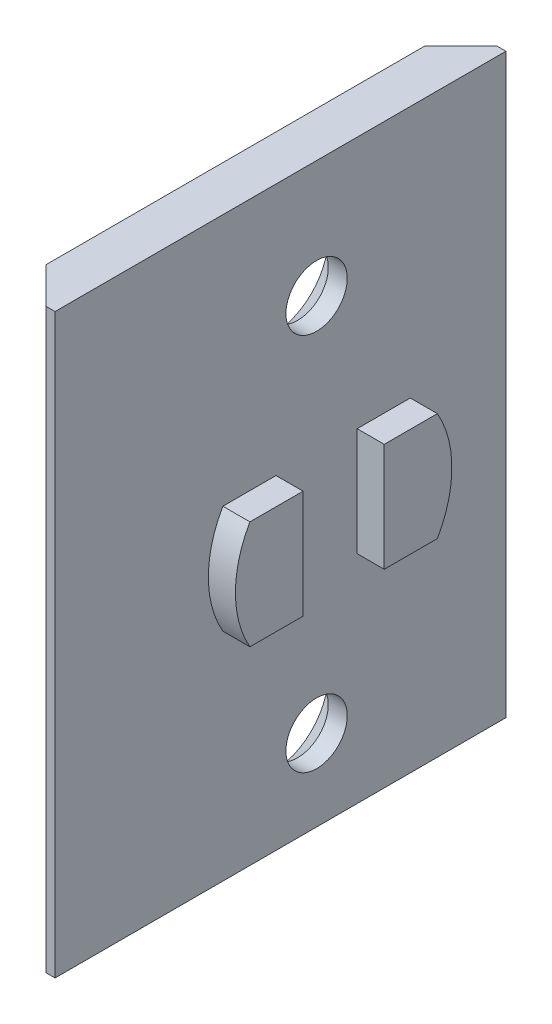
ISO-10303-21;
HEADER;
FILE_DESCRIPTION(('STEP AP214'),'2;1');
FILE_NAME('part.step','',(''),(''),'','','');
FILE_SCHEMA(('AUTOMOTIVE_DESIGN { 1 0 10303 214 1 1 1 1 }'));
ENDSEC;
DATA;
#1=APPLICATION_CONTEXT('core data for automotive mechanical design processes');
#2=APPLICATION_PROTOCOL_DEFINITION('international standard','automotive_design',2000,#1);
#3=PRODUCT_CONTEXT('',#1,'mechanical');
#4=PRODUCT('Part','Part','',(#3));
#5=PRODUCT_RELATED_PRODUCT_CATEGORY('part','',(#4));
#6=PRODUCT_DEFINITION_FORMATION('','',#4);
#7=PRODUCT_DEFINITION_CONTEXT('part definition',#1,'design');
#8=PRODUCT_DEFINITION('design','',#6,#7);
#9=PRODUCT_DEFINITION_SHAPE('','',#8);
#10=(LENGTH_UNIT() NAMED_UNIT(*) SI_UNIT(.MILLI.,.METRE.));
#11=(NAMED_UNIT(*) PLANE_ANGLE_UNIT() SI_UNIT($,.RADIAN.));
#12=(NAMED_UNIT(*) SI_UNIT($,.STERADIAN.) SOLID_ANGLE_UNIT());
#13=UNCERTAINTY_MEASURE_WITH_UNIT(LENGTH_MEASURE(1.E-05),#10,'distance_accuracy_value','');
#14=(GEOMETRIC_REPRESENTATION_CONTEXT(3) GLOBAL_UNCERTAINTY_ASSIGNED_CONTEXT((#13)) GLOBAL_UNIT_ASSIGNED_CONTEXT((#10,
#11,#12)) REPRESENTATION_CONTEXT('',''));
#15=CARTESIAN_POINT('',(0.,0.,0.));
#16=DIRECTION('',(0.,0.,1.));
#17=DIRECTION('',(1.,0.,0.));
#18=AXIS2_PLACEMENT_3D('',#15,#16,#17);
#19=CARTESIAN_POINT('',(4.,-1.,-2.00000000000008));
#20=DIRECTION('',(-1.,0.,0.));
#21=DIRECTION('',(0.,0.,1.00000000000003));
#22=AXIS2_PLACEMENT_3D('',#19,#20,#21);
#23=CYLINDRICAL_SURFACE('',#22,6.);
#24=DIRECTION('',(1.,0.,0.));
#25=VECTOR('',#24,1.);
#26=CARTESIAN_POINT('',(-8.31665382639201,-4.,3.19615242270658));
#27=LINE('',#26,#25);
#28=CARTESIAN_POINT('',(2.49999999999999,-4.,3.19615242270657));
#29=VERTEX_POINT('',#28);
#30=CARTESIAN_POINT('',(3.99999999999999,-4.,3.1961524227066));
#31=VERTEX_POINT('',#30);
#32=EDGE_CURVE('E53',#29,#31,#27,.T.);
#33=ORIENTED_EDGE('',*,*,#32,.T.);
#34=CARTESIAN_POINT('',(4.,-1.,-2.00000000000008));
#35=DIRECTION('',(1.,0.,0.));
#36=DIRECTION('',(0.,0.,-1.00000000000003));
#37=AXIS2_PLACEMENT_3D('',#34,#35,#36);
#38=CIRCLE('',#37,6.);
#39=CARTESIAN_POINT('',(4.,2.,3.1961524227066));
#40=VERTEX_POINT('',#39);
#41=EDGE_CURVE('E183',#40,#31,#38,.T.);
#42=ORIENTED_EDGE('',*,*,#41,.F.);
#43=DIRECTION('',(1.,0.,0.));
#44=VECTOR('',#43,1.);
#45=CARTESIAN_POINT('',(-8.31665382639201,2.00000000000001,3.19615242270658));
#46=LINE('',#45,#44);
#47=CARTESIAN_POINT('',(2.49999999999999,2.,3.1961524227066));
#48=VERTEX_POINT('',#47);
#49=EDGE_CURVE('E162',#48,#40,#46,.T.);
#50=ORIENTED_EDGE('',*,*,#49,.F.);
#51=CARTESIAN_POINT('',(2.5,-1.,-2.00000000000008));
#52=DIRECTION('',(-1.,0.,0.));
#53=DIRECTION('',(0.,0.,1.00000000000003));
#54=AXIS2_PLACEMENT_3D('',#51,#52,#53);
#55=CIRCLE('',#54,6.);
#56=EDGE_CURVE('E42',#48,#29,#55,.F.);
#57=ORIENTED_EDGE('',*,*,#56,.T.);
#58=EDGE_LOOP('',(#33,#42,#50,#57));
#59=FACE_BOUND('',#58,.T.);
#60=ADVANCED_FACE('F38',(#59),#23,.T.);
#61=CARTESIAN_POINT('',(4.,0.,0.));
#62=DIRECTION('',(1.,0.,0.));
#63=DIRECTION('',(0.,0.,-1.00000000000003));
#64=AXIS2_PLACEMENT_3D('',#61,#62,#63);
#65=PLANE('',#64);
#66=ORIENTED_EDGE('',*,*,#41,.T.);
#67=DIRECTION('',(0.,0.,-1.));
#68=VECTOR('',#67,1.);
#69=CARTESIAN_POINT('',(4.,-4.,0.));
#70=LINE('',#69,#68);
#71=CARTESIAN_POINT('',(4.,-4.,0.249999999999979));
#72=VERTEX_POINT('',#71);
#73=EDGE_CURVE('E260',#31,#72,#70,.T.);
#74=ORIENTED_EDGE('',*,*,#73,.T.);
#75=DIRECTION('',(0.,1.,0.));
#76=VECTOR('',#75,1.);
#77=CARTESIAN_POINT('',(4.,0.,0.24999999999999));
#78=LINE('',#77,#76);
#79=CARTESIAN_POINT('',(4.,2.,0.249999999999999));
#80=VERTEX_POINT('',#79);
#81=EDGE_CURVE('E179',#72,#80,#78,.T.);
#82=ORIENTED_EDGE('',*,*,#81,.T.);
#83=DIRECTION('',(0.,0.,-1.));
#84=VECTOR('',#83,1.);
#85=CARTESIAN_POINT('',(4.,2.,0.));
#86=LINE('',#85,#84);
#87=EDGE_CURVE('E166',#40,#80,#86,.T.);
#88=ORIENTED_EDGE('',*,*,#87,.F.);
#89=EDGE_LOOP('',(#66,#74,#82,#88));
#90=FACE_BOUND('',#89,.T.);
#91=ADVANCED_FACE('F281',(#90),#65,.T.);
#92=CARTESIAN_POINT('',(4.,0.,-4.25000000000014));
#93=DIRECTION('',(0.,0.,1.00000000000003));
#94=DIRECTION('',(1.,0.,0.));
#95=AXIS2_PLACEMENT_3D('',#92,#93,#94);
#96=PLANE('',#95);
#97=DIRECTION('',(0.,1.,0.));
#98=VECTOR('',#97,1.);
#99=CARTESIAN_POINT('',(2.5,0.,-4.25000000000014));
#100=LINE('',#99,#98);
#101=CARTESIAN_POINT('',(2.5,-4.,-4.25000000000015));
#102=VERTEX_POINT('',#101);
#103=CARTESIAN_POINT('',(2.50000000000001,2.,-4.25000000000014));
#104=VERTEX_POINT('',#103);
#105=EDGE_CURVE('E157',#102,#104,#100,.T.);
#106=ORIENTED_EDGE('',*,*,#105,.F.);
#107=DIRECTION('',(1.,0.,0.));
#108=VECTOR('',#107,1.);
#109=CARTESIAN_POINT('',(4.,-4.,-4.25000000000016));
#110=LINE('',#109,#108);
#111=CARTESIAN_POINT('',(4.,-4.,-4.25000000000009));
#112=VERTEX_POINT('',#111);
#113=EDGE_CURVE('E143',#102,#112,#110,.T.);
#114=ORIENTED_EDGE('',*,*,#113,.T.);
#115=DIRECTION('',(0.,1.,0.));
#116=VECTOR('',#115,1.);
#117=CARTESIAN_POINT('',(4.,0.,-4.25000000000014));
#118=LINE('',#117,#116);
#119=CARTESIAN_POINT('',(4.00000000000001,2.,-4.25000000000009));
#120=VERTEX_POINT('',#119);
#121=EDGE_CURVE('E177',#112,#120,#118,.T.);
#122=ORIENTED_EDGE('',*,*,#121,.T.);
#123=DIRECTION('',(1.,0.,0.));
#124=VECTOR('',#123,1.);
#125=CARTESIAN_POINT('',(4.,2.,-4.25000000000014));
#126=LINE('',#125,#124);
#127=EDGE_CURVE('E175',#104,#120,#126,.T.);
#128=ORIENTED_EDGE('',*,*,#127,.F.);
#129=EDGE_LOOP('',(#106,#114,#122,#128));
#130=FACE_BOUND('',#129,.T.);
#131=ADVANCED_FACE('F284',(#130),#96,.T.);
#132=CARTESIAN_POINT('',(4.,0.,0.24999999999999));
#133=DIRECTION('',(0.,0.,1.00000000000003));
#134=DIRECTION('',(1.,0.,0.));
#135=AXIS2_PLACEMENT_3D('',#132,#133,#134);
#136=PLANE('',#135);
#137=DIRECTION('',(1.,0.,0.));
#138=VECTOR('',#137,1.);
#139=CARTESIAN_POINT('',(4.,-4.,0.249999999999978));
#140=LINE('',#139,#138);
#141=CARTESIAN_POINT('',(2.5,-4.,0.250000000000004));
#142=VERTEX_POINT('',#141);
#143=EDGE_CURVE('E264',#142,#72,#140,.T.);
#144=ORIENTED_EDGE('',*,*,#143,.F.);
#145=DIRECTION('',(0.,1.,0.));
#146=VECTOR('',#145,1.);
#147=CARTESIAN_POINT('',(2.5,0.,0.24999999999999));
#148=LINE('',#147,#146);
#149=CARTESIAN_POINT('',(2.5,2.,0.250000000000005));
#150=VERTEX_POINT('',#149);
#151=EDGE_CURVE('E180',#142,#150,#148,.T.);
#152=ORIENTED_EDGE('',*,*,#151,.T.);
#153=DIRECTION('',(1.,0.,0.));
#154=VECTOR('',#153,1.);
#155=CARTESIAN_POINT('',(4.,2.,0.249999999999997));
#156=LINE('',#155,#154);
#157=EDGE_CURVE('E172',#150,#80,#156,.T.);
#158=ORIENTED_EDGE('',*,*,#157,.T.);
#159=ORIENTED_EDGE('',*,*,#81,.F.);
#160=EDGE_LOOP('',(#144,#152,#158,#159));
#161=FACE_BOUND('',#160,.T.);
#162=ADVANCED_FACE('F278',(#161),#136,.F.);
#163=DIRECTION('',(1.,0.,0.));
#164=VECTOR('',#163,1.);
#165=CARTESIAN_POINT('',(-8.31665382639199,-4.,-7.19615242270675));
#166=LINE('',#165,#164);
#167=CARTESIAN_POINT('',(2.49999999999999,-4.,-7.19615242270673));
#168=VERTEX_POINT('',#167);
#169=CARTESIAN_POINT('',(4.00000000000001,-4.,-7.19615242270672));
#170=VERTEX_POINT('',#169);
#171=EDGE_CURVE('E140',#168,#170,#166,.T.);
#172=ORIENTED_EDGE('',*,*,#171,.F.);
#173=CARTESIAN_POINT('',(2.50000000000001,2.,-7.19615242270673));
#174=VERTEX_POINT('',#173);
#175=EDGE_CURVE('E11',#168,#174,#55,.F.);
#176=ORIENTED_EDGE('',*,*,#175,.T.);
#177=DIRECTION('',(1.,0.,0.));
#178=VECTOR('',#177,1.);
#179=CARTESIAN_POINT('',(-8.31665382639199,2.00000000000001,-7.19615242270675));
#180=LINE('',#179,#178);
#181=CARTESIAN_POINT('',(4.00000000000001,2.,-7.19615242270673));
#182=VERTEX_POINT('',#181);
#183=EDGE_CURVE('E165',#174,#182,#180,.T.);
#184=ORIENTED_EDGE('',*,*,#183,.T.);
#185=EDGE_CURVE('E150',#170,#182,#38,.T.);
#186=ORIENTED_EDGE('',*,*,#185,.F.);
#187=EDGE_LOOP('',(#172,#176,#184,#186));
#188=FACE_BOUND('',#187,.T.);
#189=ADVANCED_FACE('F149',(#188),#23,.T.);
#190=ORIENTED_EDGE('',*,*,#121,.F.);
#191=EDGE_CURVE('E263',#112,#170,#70,.T.);
#192=ORIENTED_EDGE('',*,*,#191,.T.);
#193=ORIENTED_EDGE('',*,*,#185,.T.);
#194=EDGE_CURVE('E265',#120,#182,#86,.T.);
#195=ORIENTED_EDGE('',*,*,#194,.F.);
#196=EDGE_LOOP('',(#190,#192,#193,#195));
#197=FACE_BOUND('',#196,.T.);
#198=ADVANCED_FACE('F283',(#197),#65,.T.);
#199=CARTESIAN_POINT('',(2.5,-16.,-12.5000000000003));
#200=DIRECTION('',(0.,0.,1.00000000000003));
#201=DIRECTION('',(1.,0.,0.));
#202=AXIS2_PLACEMENT_3D('',#199,#200,#201);
#203=PLANE('',#202);
#204=DIRECTION('',(-1.,0.,0.));
#205=VECTOR('',#204,1.);
#206=CARTESIAN_POINT('',(2.5,-16.,-12.5000000000003));
#207=LINE('',#206,#205);
#208=CARTESIAN_POINT('',(2.5,-16.,-12.5000000000003));
#209=VERTEX_POINT('',#208);
#210=CARTESIAN_POINT('',(2.,-16.,-12.5000000000003));
#211=VERTEX_POINT('',#210);
#212=EDGE_CURVE('E215',#209,#211,#207,.T.);
#213=ORIENTED_EDGE('',*,*,#212,.T.);
#214=DIRECTION('',(0.,1.,0.));
#215=VECTOR('',#214,1.);
#216=CARTESIAN_POINT('',(2.,16.,-12.5000000000005));
#217=LINE('',#216,#215);
#218=CARTESIAN_POINT('',(2.,16.,-12.5000000000005));
#219=VERTEX_POINT('',#218);
#220=EDGE_CURVE('E245',#211,#219,#217,.T.);
#221=ORIENTED_EDGE('',*,*,#220,.T.);
#222=DIRECTION('',(-1.,0.,0.));
#223=VECTOR('',#222,1.);
#224=CARTESIAN_POINT('',(2.5,16.,-12.5000000000005));
#225=LINE('',#224,#223);
#226=CARTESIAN_POINT('',(2.5,16.,-12.5000000000005));
#227=VERTEX_POINT('',#226);
#228=EDGE_CURVE('E228',#227,#219,#225,.T.);
#229=ORIENTED_EDGE('',*,*,#228,.F.);
#230=DIRECTION('',(0.,1.,0.));
#231=VECTOR('',#230,1.);
#232=CARTESIAN_POINT('',(2.5,-16.,-12.5000000000003));
#233=LINE('',#232,#231);
#234=EDGE_CURVE('E205',#209,#227,#233,.T.);
#235=ORIENTED_EDGE('',*,*,#234,.F.);
#236=EDGE_LOOP('',(#213,#221,#229,#235));
#237=FACE_BOUND('',#236,.T.);
#238=ADVANCED_FACE('F307',(#237),#203,.F.);
#239=CARTESIAN_POINT('',(2.5,16.,12.5000000000005));
#240=DIRECTION('',(0.,-1.,0.));
#241=DIRECTION('',(0.,0.,-1.00000000000003));
#242=AXIS2_PLACEMENT_3D('',#239,#240,#241);
#243=PLANE('',#242);
#244=DIRECTION('',(0.,0.,1.00000000000003));
#245=VECTOR('',#244,1.);
#246=CARTESIAN_POINT('',(0.,16.,12.5000000000003));
#247=LINE('',#246,#245);
#248=CARTESIAN_POINT('',(0.,16.,-10.5000000000005));
#249=VERTEX_POINT('',#248);
#250=CARTESIAN_POINT('',(0.,16.,10.5000000000003));
#251=VERTEX_POINT('',#250);
#252=EDGE_CURVE('E204',#249,#251,#247,.T.);
#253=ORIENTED_EDGE('',*,*,#252,.T.);
#254=DIRECTION('',(0.707106781186547,0.,0.707106781186564));
#255=VECTOR('',#254,1.);
#256=CARTESIAN_POINT('',(2.,16.,12.5000000000005));
#257=LINE('',#256,#255);
#258=CARTESIAN_POINT('',(2.,16.,12.5000000000005));
#259=VERTEX_POINT('',#258);
#260=EDGE_CURVE('E244',#251,#259,#257,.T.);
#261=ORIENTED_EDGE('',*,*,#260,.T.);
#262=DIRECTION('',(-1.,0.,0.));
#263=VECTOR('',#262,1.);
#264=CARTESIAN_POINT('',(2.5,16.,12.5000000000005));
#265=LINE('',#264,#263);
#266=CARTESIAN_POINT('',(2.5,16.,12.5000000000005));
#267=VERTEX_POINT('',#266);
#268=EDGE_CURVE('E225',#267,#259,#265,.T.);
#269=ORIENTED_EDGE('',*,*,#268,.F.);
#270=DIRECTION('',(0.,0.,1.00000000000003));
#271=VECTOR('',#270,1.);
#272=CARTESIAN_POINT('',(2.5,16.,12.5000000000005));
#273=LINE('',#272,#271);
#274=EDGE_CURVE('E208',#227,#267,#273,.T.);
#275=ORIENTED_EDGE('',*,*,#274,.F.);
#276=ORIENTED_EDGE('',*,*,#228,.T.);
#277=DIRECTION('',(-0.707106781186547,0.,0.707106781186564));
#278=VECTOR('',#277,1.);
#279=CARTESIAN_POINT('',(2.,16.,-12.5000000000005));
#280=LINE('',#279,#278);
#281=EDGE_CURVE('E242',#219,#249,#280,.T.);
#282=ORIENTED_EDGE('',*,*,#281,.T.);
#283=EDGE_LOOP('',(#253,#261,#269,#275,#276,#282));
#284=FACE_BOUND('',#283,.T.);
#285=ADVANCED_FACE('F340',(#284),#243,.F.);
#286=CARTESIAN_POINT('',(2.5,-16.,12.5000000000005));
#287=DIRECTION('',(0.,0.,-1.00000000000003));
#288=DIRECTION('',(-1.,0.,0.));
#289=AXIS2_PLACEMENT_3D('',#286,#287,#288);
#290=PLANE('',#289);
#291=ORIENTED_EDGE('',*,*,#268,.T.);
#292=DIRECTION('',(0.,-1.,0.));
#293=VECTOR('',#292,1.);
#294=CARTESIAN_POINT('',(2.,-16.,12.5000000000005));
#295=LINE('',#294,#293);
#296=CARTESIAN_POINT('',(2.,-16.,12.5000000000005));
#297=VERTEX_POINT('',#296);
#298=EDGE_CURVE('E231',#259,#297,#295,.T.);
#299=ORIENTED_EDGE('',*,*,#298,.T.);
#300=DIRECTION('',(-1.,0.,0.));
#301=VECTOR('',#300,1.);
#302=CARTESIAN_POINT('',(2.5,-16.,12.5000000000005));
#303=LINE('',#302,#301);
#304=CARTESIAN_POINT('',(2.5,-16.,12.5000000000005));
#305=VERTEX_POINT('',#304);
#306=EDGE_CURVE('E222',#305,#297,#303,.T.);
#307=ORIENTED_EDGE('',*,*,#306,.F.);
#308=DIRECTION('',(0.,-1.,0.));
#309=VECTOR('',#308,1.);
#310=CARTESIAN_POINT('',(2.5,-16.,12.5000000000005));
#311=LINE('',#310,#309);
#312=EDGE_CURVE('E211',#267,#305,#311,.T.);
#313=ORIENTED_EDGE('',*,*,#312,.F.);
#314=EDGE_LOOP('',(#291,#299,#307,#313));
#315=FACE_BOUND('',#314,.T.);
#316=ADVANCED_FACE('F336',(#315),#290,.F.);
#317=CARTESIAN_POINT('',(2.5,-16.,12.5000000000005));
#318=DIRECTION('',(0.,1.,0.));
#319=DIRECTION('',(0.,0.,1.00000000000003));
#320=AXIS2_PLACEMENT_3D('',#317,#318,#319);
#321=PLANE('',#320);
#322=ORIENTED_EDGE('',*,*,#306,.T.);
#323=DIRECTION('',(-0.707106781186547,0.,-0.707106781186564));
#324=VECTOR('',#323,1.);
#325=CARTESIAN_POINT('',(2.,-16.,12.5000000000005));
#326=LINE('',#325,#324);
#327=CARTESIAN_POINT('',(0.,-16.,10.5000000000005));
#328=VERTEX_POINT('',#327);
#329=EDGE_CURVE('E236',#297,#328,#326,.T.);
#330=ORIENTED_EDGE('',*,*,#329,.T.);
#331=DIRECTION('',(0.,0.,-1.00000000000003));
#332=VECTOR('',#331,1.);
#333=CARTESIAN_POINT('',(0.,-16.,12.5000000000005));
#334=LINE('',#333,#332);
#335=CARTESIAN_POINT('',(0.,-16.,-10.5000000000002));
#336=VERTEX_POINT('',#335);
#337=EDGE_CURVE('E209',#328,#336,#334,.T.);
#338=ORIENTED_EDGE('',*,*,#337,.T.);
#339=DIRECTION('',(0.707106781186547,0.,-0.707106781186564));
#340=VECTOR('',#339,1.);
#341=CARTESIAN_POINT('',(2.,-16.,-12.5000000000003));
#342=LINE('',#341,#340);
#343=EDGE_CURVE('E234',#336,#211,#342,.T.);
#344=ORIENTED_EDGE('',*,*,#343,.T.);
#345=ORIENTED_EDGE('',*,*,#212,.F.);
#346=DIRECTION('',(0.,0.,-1.00000000000003));
#347=VECTOR('',#346,1.);
#348=CARTESIAN_POINT('',(2.5,-16.,12.5000000000005));
#349=LINE('',#348,#347);
#350=EDGE_CURVE('E213',#305,#209,#349,.T.);
#351=ORIENTED_EDGE('',*,*,#350,.F.);
#352=EDGE_LOOP('',(#322,#330,#338,#344,#345,#351));
#353=FACE_BOUND('',#352,.T.);
#354=ADVANCED_FACE('F332',(#353),#321,.F.);
#355=CARTESIAN_POINT('',(0.,0.,0.));
#356=DIRECTION('',(-1.,0.,0.));
#357=DIRECTION('',(0.,0.,1.00000000000003));
#358=AXIS2_PLACEMENT_3D('',#355,#356,#357);
#359=PLANE('',#358);
#360=CARTESIAN_POINT('',(0.,-11.5,-2.00000000000007));
#361=DIRECTION('',(-1.,0.,0.));
#362=DIRECTION('',(0.,0.,1.00000000000003));
#363=AXIS2_PLACEMENT_3D('',#360,#361,#362);
#364=CIRCLE('',#363,3.15);
#365=CARTESIAN_POINT('',(0.,-11.5,1.15000000000003));
#366=VERTEX_POINT('',#365);
#367=EDGE_CURVE('E186',#366,#366,#364,.T.);
#368=ORIENTED_EDGE('',*,*,#367,.F.);
#369=EDGE_LOOP('',(#368));
#370=FACE_BOUND('',#369,.T.);
#371=CARTESIAN_POINT('',(0.,9.5,-2.00000000000014));
#372=DIRECTION('',(-1.,0.,0.));
#373=DIRECTION('',(0.,0.,1.00000000000003));
#374=AXIS2_PLACEMENT_3D('',#371,#372,#373);
#375=CIRCLE('',#374,3.15);
#376=CARTESIAN_POINT('',(0.,9.49999999999999,1.14999999999996));
#377=VERTEX_POINT('',#376);
#378=EDGE_CURVE('E195',#377,#377,#375,.T.);
#379=ORIENTED_EDGE('',*,*,#378,.F.);
#380=EDGE_LOOP('',(#379));
#381=FACE_BOUND('',#380,.T.);
#382=ORIENTED_EDGE('',*,*,#337,.F.);
#383=DIRECTION('',(0.,1.,0.));
#384=VECTOR('',#383,1.);
#385=CARTESIAN_POINT('',(0.,16.,10.5000000000003));
#386=LINE('',#385,#384);
#387=EDGE_CURVE('E240',#328,#251,#386,.T.);
#388=ORIENTED_EDGE('',*,*,#387,.T.);
#389=ORIENTED_EDGE('',*,*,#252,.F.);
#390=DIRECTION('',(0.,-1.,0.));
#391=VECTOR('',#390,1.);
#392=CARTESIAN_POINT('',(0.,-16.,-10.5000000000002));
#393=LINE('',#392,#391);
#394=EDGE_CURVE('E238',#249,#336,#393,.T.);
#395=ORIENTED_EDGE('',*,*,#394,.T.);
#396=EDGE_LOOP('',(#382,#388,#389,#395));
#397=FACE_BOUND('',#396,.T.);
#398=ADVANCED_FACE('F328',(#370,#381,#397),#359,.T.);
#399=CARTESIAN_POINT('',(2.,-16.,12.5000000000005));
#400=DIRECTION('',(-0.707106781186548,0.,0.707106781186563));
#401=DIRECTION('',(0.,1.,0.));
#402=AXIS2_PLACEMENT_3D('',#399,#400,#401);
#403=PLANE('',#402);
#404=ORIENTED_EDGE('',*,*,#260,.F.);
#405=ORIENTED_EDGE('',*,*,#387,.F.);
#406=ORIENTED_EDGE('',*,*,#329,.F.);
#407=ORIENTED_EDGE('',*,*,#298,.F.);
#408=EDGE_LOOP('',(#404,#405,#406,#407));
#409=FACE_BOUND('',#408,.T.);
#410=ADVANCED_FACE('F331',(#409),#403,.T.);
#411=CARTESIAN_POINT('',(2.,-16.,-12.5000000000003));
#412=DIRECTION('',(-0.707106781186548,0.,-0.707106781186563));
#413=DIRECTION('',(0.,-1.,0.));
#414=AXIS2_PLACEMENT_3D('',#411,#412,#413);
#415=PLANE('',#414);
#416=ORIENTED_EDGE('',*,*,#343,.F.);
#417=ORIENTED_EDGE('',*,*,#394,.F.);
#418=ORIENTED_EDGE('',*,*,#281,.F.);
#419=ORIENTED_EDGE('',*,*,#220,.F.);
#420=EDGE_LOOP('',(#416,#417,#418,#419));
#421=FACE_BOUND('',#420,.T.);
#422=ADVANCED_FACE('F40',(#421),#415,.T.);
#423=CARTESIAN_POINT('',(0.,9.5,-2.00000000000014));
#424=DIRECTION('',(-1.,0.,0.));
#425=DIRECTION('',(0.,0.,1.00000000000003));
#426=AXIS2_PLACEMENT_3D('',#423,#424,#425);
#427=CYLINDRICAL_SURFACE('',#426,1.7);
#428=CARTESIAN_POINT('',(2.5,9.5,-2.00000000000014));
#429=DIRECTION('',(-1.,0.,0.));
#430=DIRECTION('',(0.,0.,1.00000000000003));
#431=AXIS2_PLACEMENT_3D('',#428,#429,#430);
#432=CIRCLE('',#431,1.7);
#433=CARTESIAN_POINT('',(2.5,9.49999999999999,-0.300000000000088));
#434=VERTEX_POINT('',#433);
#435=EDGE_CURVE('E201',#434,#434,#432,.T.);
#436=ORIENTED_EDGE('',*,*,#435,.F.);
#437=EDGE_LOOP('',(#436));
#438=FACE_BOUND('',#437,.T.);
#439=CARTESIAN_POINT('',(1.45,9.5,-2.00000000000014));
#440=DIRECTION('',(-1.,0.,0.));
#441=DIRECTION('',(0.,0.,1.00000000000003));
#442=AXIS2_PLACEMENT_3D('',#439,#440,#441);
#443=CIRCLE('',#442,1.7);
#444=CARTESIAN_POINT('',(1.45000000000001,9.49999999999999,-0.300000000000088));
#445=VERTEX_POINT('',#444);
#446=EDGE_CURVE('E198',#445,#445,#443,.T.);
#447=ORIENTED_EDGE('',*,*,#446,.T.);
#448=EDGE_LOOP('',(#447));
#449=FACE_BOUND('',#448,.T.);
#450=ADVANCED_FACE('F323',(#438,#449),#427,.F.);
#451=CARTESIAN_POINT('',(0.,9.5,-2.00000000000014));
#452=DIRECTION('',(-1.,0.,0.));
#453=DIRECTION('',(0.,0.,1.00000000000003));
#454=AXIS2_PLACEMENT_3D('',#451,#452,#453);
#455=CONICAL_SURFACE('',#454,3.15,0.785398163397448);
#456=ORIENTED_EDGE('',*,*,#446,.F.);
#457=EDGE_LOOP('',(#456));
#458=FACE_BOUND('',#457,.T.);
#459=ORIENTED_EDGE('',*,*,#378,.T.);
#460=EDGE_LOOP('',(#459));
#461=FACE_BOUND('',#460,.T.);
#462=ADVANCED_FACE('F319',(#458,#461),#455,.F.);
#463=CARTESIAN_POINT('',(0.,-11.5,-2.00000000000007));
#464=DIRECTION('',(-1.,0.,0.));
#465=DIRECTION('',(0.,0.,1.00000000000003));
#466=AXIS2_PLACEMENT_3D('',#463,#464,#465);
#467=CYLINDRICAL_SURFACE('',#466,1.7);
#468=CARTESIAN_POINT('',(2.5,-11.5,-2.00000000000001));
#469=DIRECTION('',(-1.,0.,0.));
#470=DIRECTION('',(0.,0.,1.00000000000003));
#471=AXIS2_PLACEMENT_3D('',#468,#469,#470);
#472=CIRCLE('',#471,1.7);
#473=CARTESIAN_POINT('',(2.5,-11.5,-0.29999999999996));
#474=VERTEX_POINT('',#473);
#475=EDGE_CURVE('E192',#474,#474,#472,.T.);
#476=ORIENTED_EDGE('',*,*,#475,.F.);
#477=EDGE_LOOP('',(#476));
#478=FACE_BOUND('',#477,.T.);
#479=CARTESIAN_POINT('',(1.45,-11.5,-2.00000000000001));
#480=DIRECTION('',(-1.,0.,0.));
#481=DIRECTION('',(0.,0.,1.00000000000003));
#482=AXIS2_PLACEMENT_3D('',#479,#480,#481);
#483=CIRCLE('',#482,1.7);
#484=CARTESIAN_POINT('',(1.45000000000001,-11.5,-0.29999999999996));
#485=VERTEX_POINT('',#484);
#486=EDGE_CURVE('E189',#485,#485,#483,.T.);
#487=ORIENTED_EDGE('',*,*,#486,.T.);
#488=EDGE_LOOP('',(#487));
#489=FACE_BOUND('',#488,.T.);
#490=ADVANCED_FACE('F315',(#478,#489),#467,.F.);
#491=CARTESIAN_POINT('',(0.,-11.5,-2.00000000000007));
#492=DIRECTION('',(-1.,0.,0.));
#493=DIRECTION('',(0.,0.,1.00000000000003));
#494=AXIS2_PLACEMENT_3D('',#491,#492,#493);
#495=CONICAL_SURFACE('',#494,3.15,0.785398163397448);
#496=ORIENTED_EDGE('',*,*,#486,.F.);
#497=EDGE_LOOP('',(#496));
#498=FACE_BOUND('',#497,.T.);
#499=ORIENTED_EDGE('',*,*,#367,.T.);
#500=EDGE_LOOP('',(#499));
#501=FACE_BOUND('',#500,.T.);
#502=ADVANCED_FACE('F292',(#498,#501),#495,.F.);
#503=CARTESIAN_POINT('',(2.5,0.,0.));
#504=DIRECTION('',(-1.,0.,0.));
#505=DIRECTION('',(0.,0.,1.00000000000003));
#506=AXIS2_PLACEMENT_3D('',#503,#504,#505);
#507=PLANE('',#506);
#508=DIRECTION('',(0.,0.,-1.));
#509=VECTOR('',#508,1.);
#510=CARTESIAN_POINT('',(2.5,-4.,0.));
#511=LINE('',#510,#509);
#512=EDGE_CURVE('E138',#102,#168,#511,.T.);
#513=ORIENTED_EDGE('',*,*,#512,.F.);
#514=ORIENTED_EDGE('',*,*,#105,.T.);
#515=DIRECTION('',(0.,0.,-1.));
#516=VECTOR('',#515,1.);
#517=CARTESIAN_POINT('',(2.5,2.,0.));
#518=LINE('',#517,#516);
#519=EDGE_CURVE('E156',#104,#174,#518,.T.);
#520=ORIENTED_EDGE('',*,*,#519,.T.);
#521=ORIENTED_EDGE('',*,*,#175,.F.);
#522=EDGE_LOOP('',(#513,#514,#520,#521));
#523=FACE_BOUND('',#522,.T.);
#524=ORIENTED_EDGE('',*,*,#151,.F.);
#525=EDGE_CURVE('E146',#29,#142,#511,.T.);
#526=ORIENTED_EDGE('',*,*,#525,.F.);
#527=ORIENTED_EDGE('',*,*,#56,.F.);
#528=EDGE_CURVE('E161',#48,#150,#518,.T.);
#529=ORIENTED_EDGE('',*,*,#528,.T.);
#530=EDGE_LOOP('',(#524,#526,#527,#529));
#531=FACE_BOUND('',#530,.T.);
#532=ORIENTED_EDGE('',*,*,#234,.T.);
#533=ORIENTED_EDGE('',*,*,#274,.T.);
#534=ORIENTED_EDGE('',*,*,#312,.T.);
#535=ORIENTED_EDGE('',*,*,#350,.T.);
#536=EDGE_LOOP('',(#532,#533,#534,#535));
#537=FACE_BOUND('',#536,.T.);
#538=ORIENTED_EDGE('',*,*,#435,.T.);
#539=EDGE_LOOP('',(#538));
#540=FACE_BOUND('',#539,.T.);
#541=ORIENTED_EDGE('',*,*,#475,.T.);
#542=EDGE_LOOP('',(#541));
#543=FACE_BOUND('',#542,.T.);
#544=ADVANCED_FACE('F153',(#523,#531,#537,#540,#543),#507,.F.);
#545=CARTESIAN_POINT('',(-8.31665382639201,2.00000000000001,0.));
#546=DIRECTION('',(0.,-1.,0.));
#547=DIRECTION('',(1.,0.,0.));
#548=AXIS2_PLACEMENT_3D('',#545,#546,#547);
#549=PLANE('',#548);
#550=ORIENTED_EDGE('',*,*,#127,.T.);
#551=ORIENTED_EDGE('',*,*,#194,.T.);
#552=ORIENTED_EDGE('',*,*,#183,.F.);
#553=ORIENTED_EDGE('',*,*,#519,.F.);
#554=EDGE_LOOP('',(#550,#551,#552,#553));
#555=FACE_BOUND('',#554,.T.);
#556=ADVANCED_FACE('F285',(#555),#549,.F.);
#557=ORIENTED_EDGE('',*,*,#528,.F.);
#558=ORIENTED_EDGE('',*,*,#49,.T.);
#559=ORIENTED_EDGE('',*,*,#87,.T.);
#560=ORIENTED_EDGE('',*,*,#157,.F.);
#561=EDGE_LOOP('',(#557,#558,#559,#560));
#562=FACE_BOUND('',#561,.T.);
#563=ADVANCED_FACE('F274',(#562),#549,.F.);
#564=CARTESIAN_POINT('',(-8.31665382639201,-4.,0.));
#565=DIRECTION('',(0.,-1.,0.));
#566=DIRECTION('',(1.,0.,0.));
#567=AXIS2_PLACEMENT_3D('',#564,#565,#566);
#568=PLANE('',#567);
#569=ORIENTED_EDGE('',*,*,#143,.T.);
#570=ORIENTED_EDGE('',*,*,#73,.F.);
#571=ORIENTED_EDGE('',*,*,#32,.F.);
#572=ORIENTED_EDGE('',*,*,#525,.T.);
#573=EDGE_LOOP('',(#569,#570,#571,#572));
#574=FACE_BOUND('',#573,.T.);
#575=ADVANCED_FACE('F280',(#574),#568,.T.);
#576=ORIENTED_EDGE('',*,*,#512,.T.);
#577=ORIENTED_EDGE('',*,*,#171,.T.);
#578=ORIENTED_EDGE('',*,*,#191,.F.);
#579=ORIENTED_EDGE('',*,*,#113,.F.);
#580=EDGE_LOOP('',(#576,#577,#578,#579));
#581=FACE_BOUND('',#580,.T.);
#582=ADVANCED_FACE('F139',(#581),#568,.T.);
#583=CLOSED_SHELL('',(#60,#91,#131,#162,#189,#198,#238,#285,#316,#354,#398,#410,#422,#450,#462,
#490,#502,#544,#556,#563,#575,#582));
#584=MANIFOLD_SOLID_BREP('B2',#583);
#585=ADVANCED_BREP_SHAPE_REPRESENTATION('',(#18,#584),#14);
#586=SHAPE_DEFINITION_REPRESENTATION(#9,#585);
ENDSEC;
END-ISO-10303-21;
